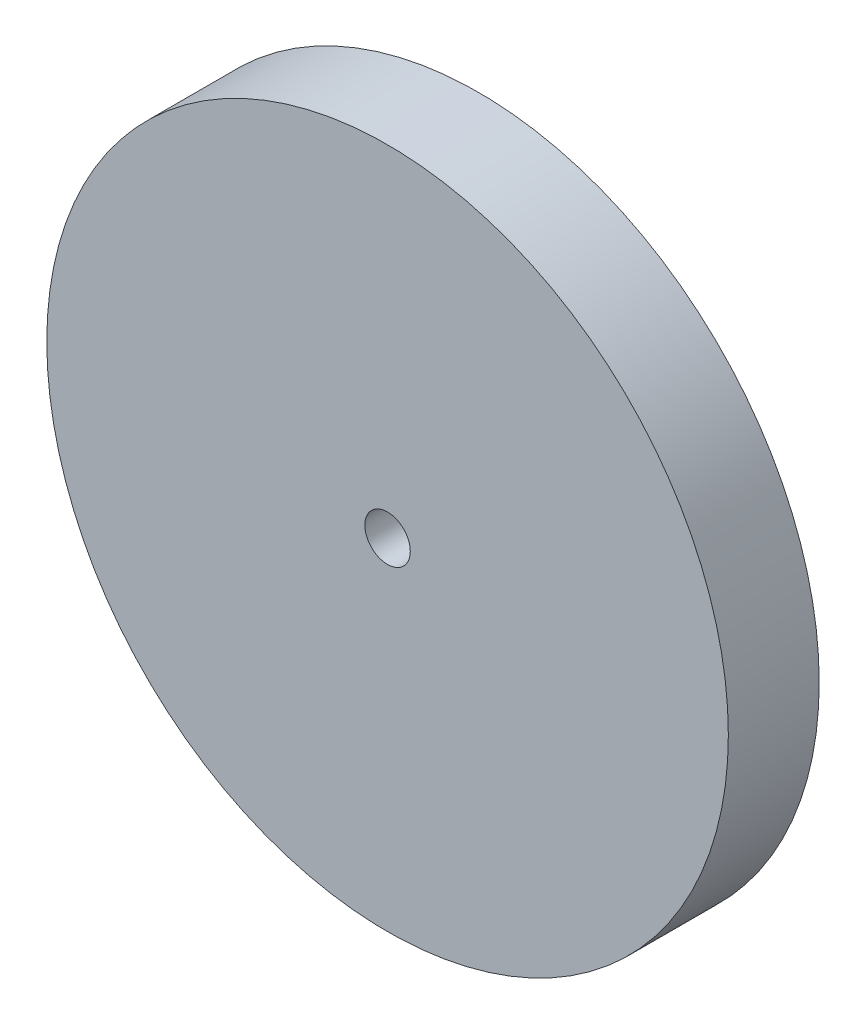
ISO-10303-21;
HEADER;
FILE_DESCRIPTION(('STEP AP214'),'2;1');
FILE_NAME('part.step','',(''),(''),'','','');
FILE_SCHEMA(('AUTOMOTIVE_DESIGN { 1 0 10303 214 1 1 1 1 }'));
ENDSEC;
DATA;
#1=APPLICATION_CONTEXT('core data for automotive mechanical design processes');
#2=APPLICATION_PROTOCOL_DEFINITION('international standard','automotive_design',2000,#1);
#3=PRODUCT_CONTEXT('',#1,'mechanical');
#4=PRODUCT('Part','Part','',(#3));
#5=PRODUCT_RELATED_PRODUCT_CATEGORY('part','',(#4));
#6=PRODUCT_DEFINITION_FORMATION('','',#4);
#7=PRODUCT_DEFINITION_CONTEXT('part definition',#1,'design');
#8=PRODUCT_DEFINITION('design','',#6,#7);
#9=PRODUCT_DEFINITION_SHAPE('','',#8);
#10=(LENGTH_UNIT() NAMED_UNIT(*) SI_UNIT(.MILLI.,.METRE.));
#11=(NAMED_UNIT(*) PLANE_ANGLE_UNIT() SI_UNIT($,.RADIAN.));
#12=(NAMED_UNIT(*) SI_UNIT($,.STERADIAN.) SOLID_ANGLE_UNIT());
#13=UNCERTAINTY_MEASURE_WITH_UNIT(LENGTH_MEASURE(1.E-05),#10,'distance_accuracy_value','');
#14=(GEOMETRIC_REPRESENTATION_CONTEXT(3) GLOBAL_UNCERTAINTY_ASSIGNED_CONTEXT((#13)) GLOBAL_UNIT_ASSIGNED_CONTEXT((#10,
#11,#12)) REPRESENTATION_CONTEXT('',''));
#15=CARTESIAN_POINT('',(0.,0.,0.));
#16=DIRECTION('',(0.,0.,1.));
#17=DIRECTION('',(1.,0.,0.));
#18=AXIS2_PLACEMENT_3D('',#15,#16,#17);
#19=CARTESIAN_POINT('',(0.,0.,4.));
#20=DIRECTION('',(0.,0.,-1.));
#21=DIRECTION('',(-1.,0.,0.));
#22=AXIS2_PLACEMENT_3D('',#19,#20,#21);
#23=CYLINDRICAL_SURFACE('',#22,15.);
#24=CARTESIAN_POINT('',(0.,0.,4.));
#25=DIRECTION('',(0.,0.,1.));
#26=DIRECTION('',(1.,0.,0.));
#27=AXIS2_PLACEMENT_3D('',#24,#25,#26);
#28=CIRCLE('',#27,15.);
#29=CARTESIAN_POINT('',(15.,0.,4.));
#30=VERTEX_POINT('',#29);
#31=EDGE_CURVE('E10',#30,#30,#28,.T.);
#32=ORIENTED_EDGE('',*,*,#31,.F.);
#33=EDGE_LOOP('',(#32));
#34=FACE_BOUND('',#33,.T.);
#35=CARTESIAN_POINT('',(0.,0.,0.));
#36=DIRECTION('',(0.,0.,1.));
#37=DIRECTION('',(1.,0.,0.));
#38=AXIS2_PLACEMENT_3D('',#35,#36,#37);
#39=CIRCLE('',#38,15.);
#40=CARTESIAN_POINT('',(15.,0.,0.));
#41=VERTEX_POINT('',#40);
#42=EDGE_CURVE('E44',#41,#41,#39,.T.);
#43=ORIENTED_EDGE('',*,*,#42,.T.);
#44=EDGE_LOOP('',(#43));
#45=FACE_BOUND('',#44,.T.);
#46=ADVANCED_FACE('F41',(#34,#45),#23,.T.);
#47=CARTESIAN_POINT('',(0.,0.,4.));
#48=DIRECTION('',(0.,0.,1.));
#49=DIRECTION('',(1.,0.,0.));
#50=AXIS2_PLACEMENT_3D('',#47,#48,#49);
#51=PLANE('',#50);
#52=CARTESIAN_POINT('',(0.,0.,4.));
#53=DIRECTION('',(0.,0.,1.));
#54=DIRECTION('',(1.,0.,0.));
#55=AXIS2_PLACEMENT_3D('',#52,#53,#54);
#56=CIRCLE('',#55,1.);
#57=CARTESIAN_POINT('',(1.,0.,4.));
#58=VERTEX_POINT('',#57);
#59=EDGE_CURVE('E55',#58,#58,#56,.T.);
#60=ORIENTED_EDGE('',*,*,#59,.F.);
#61=EDGE_LOOP('',(#60));
#62=FACE_BOUND('',#61,.T.);
#63=ORIENTED_EDGE('',*,*,#31,.T.);
#64=EDGE_LOOP('',(#63));
#65=FACE_BOUND('',#64,.T.);
#66=ADVANCED_FACE('F72',(#62,#65),#51,.T.);
#67=CARTESIAN_POINT('',(0.,0.,0.));
#68=DIRECTION('',(0.,0.,1.));
#69=DIRECTION('',(1.,0.,0.));
#70=AXIS2_PLACEMENT_3D('',#67,#68,#69);
#71=PLANE('',#70);
#72=CARTESIAN_POINT('',(0.,0.,0.));
#73=DIRECTION('',(0.,0.,1.));
#74=DIRECTION('',(1.,0.,0.));
#75=AXIS2_PLACEMENT_3D('',#72,#73,#74);
#76=CIRCLE('',#75,1.);
#77=CARTESIAN_POINT('',(1.,0.,0.));
#78=VERTEX_POINT('',#77);
#79=EDGE_CURVE('E53',#78,#78,#76,.T.);
#80=ORIENTED_EDGE('',*,*,#79,.T.);
#81=EDGE_LOOP('',(#80));
#82=FACE_BOUND('',#81,.T.);
#83=ORIENTED_EDGE('',*,*,#42,.F.);
#84=EDGE_LOOP('',(#83));
#85=FACE_BOUND('',#84,.T.);
#86=ADVANCED_FACE('F63',(#82,#85),#71,.F.);
#87=CARTESIAN_POINT('',(0.,0.,0.));
#88=DIRECTION('',(0.,0.,1.));
#89=DIRECTION('',(1.,0.,0.));
#90=AXIS2_PLACEMENT_3D('',#87,#88,#89);
#91=CYLINDRICAL_SURFACE('',#90,1.);
#92=ORIENTED_EDGE('',*,*,#79,.F.);
#93=EDGE_LOOP('',(#92));
#94=FACE_BOUND('',#93,.T.);
#95=ORIENTED_EDGE('',*,*,#59,.T.);
#96=EDGE_LOOP('',(#95));
#97=FACE_BOUND('',#96,.T.);
#98=ADVANCED_FACE('F66',(#94,#97),#91,.F.);
#99=CLOSED_SHELL('',(#46,#66,#86,#98));
#100=MANIFOLD_SOLID_BREP('B2',#99);
#101=ADVANCED_BREP_SHAPE_REPRESENTATION('',(#18,#100),#14);
#102=SHAPE_DEFINITION_REPRESENTATION(#9,#101);
ENDSEC;
END-ISO-10303-21;
